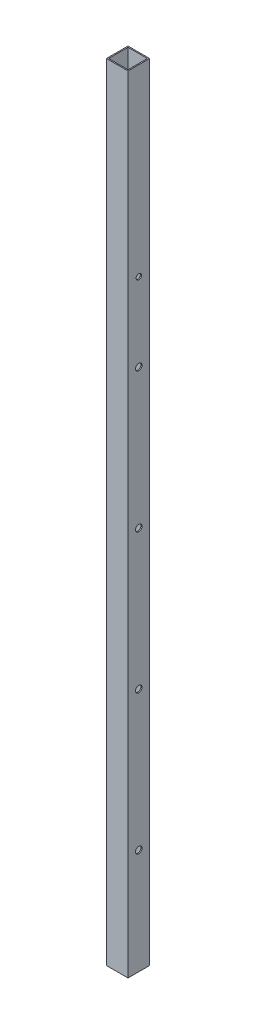
ISO-10303-21;
HEADER;
FILE_DESCRIPTION(('STEP AP214'),'2;1');
FILE_NAME('part.step','',(''),(''),'','','');
FILE_SCHEMA(('AUTOMOTIVE_DESIGN { 1 0 10303 214 1 1 1 1 }'));
ENDSEC;
DATA;
#1=APPLICATION_CONTEXT('core data for automotive mechanical design processes');
#2=APPLICATION_PROTOCOL_DEFINITION('international standard','automotive_design',2000,#1);
#3=PRODUCT_CONTEXT('',#1,'mechanical');
#4=PRODUCT('Part','Part','',(#3));
#5=PRODUCT_RELATED_PRODUCT_CATEGORY('part','',(#4));
#6=PRODUCT_DEFINITION_FORMATION('','',#4);
#7=PRODUCT_DEFINITION_CONTEXT('part definition',#1,'design');
#8=PRODUCT_DEFINITION('design','',#6,#7);
#9=PRODUCT_DEFINITION_SHAPE('','',#8);
#10=(LENGTH_UNIT() NAMED_UNIT(*) SI_UNIT(.MILLI.,.METRE.));
#11=(NAMED_UNIT(*) PLANE_ANGLE_UNIT() SI_UNIT($,.RADIAN.));
#12=(NAMED_UNIT(*) SI_UNIT($,.STERADIAN.) SOLID_ANGLE_UNIT());
#13=UNCERTAINTY_MEASURE_WITH_UNIT(LENGTH_MEASURE(1.E-05),#10,'distance_accuracy_value','');
#14=(GEOMETRIC_REPRESENTATION_CONTEXT(3) GLOBAL_UNCERTAINTY_ASSIGNED_CONTEXT((#13)) GLOBAL_UNIT_ASSIGNED_CONTEXT((#10,
#11,#12)) REPRESENTATION_CONTEXT('',''));
#15=CARTESIAN_POINT('',(0.,0.,0.));
#16=DIRECTION('',(0.,0.,1.));
#17=DIRECTION('',(1.,0.,0.));
#18=AXIS2_PLACEMENT_3D('',#15,#16,#17);
#19=CARTESIAN_POINT('',(-418.25,1630.,0.));
#20=DIRECTION('',(1.,0.,0.));
#21=DIRECTION('',(0.,0.,-1.));
#22=AXIS2_PLACEMENT_3D('',#19,#20,#21);
#23=CYLINDRICAL_SURFACE('',#22,9.52499999999999);
#24=CARTESIAN_POINT('',(28.575,1630.,0.));
#25=DIRECTION('',(-1.,0.,0.));
#26=DIRECTION('',(0.,0.,1.));
#27=AXIS2_PLACEMENT_3D('',#24,#25,#26);
#28=CIRCLE('',#27,9.52499999999999);
#29=CARTESIAN_POINT('',(28.575,1630.,9.52499999999999));
#30=VERTEX_POINT('',#29);
#31=EDGE_CURVE('E151',#30,#30,#28,.T.);
#32=ORIENTED_EDGE('',*,*,#31,.T.);
#33=EDGE_LOOP('',(#32));
#34=FACE_BOUND('',#33,.T.);
#35=CARTESIAN_POINT('',(31.75,1630.,0.));
#36=DIRECTION('',(1.,0.,0.));
#37=DIRECTION('',(0.,0.,-1.));
#38=AXIS2_PLACEMENT_3D('',#35,#36,#37);
#39=CIRCLE('',#38,9.52499999999999);
#40=CARTESIAN_POINT('',(31.75,1630.,-9.52499999999999));
#41=VERTEX_POINT('',#40);
#42=EDGE_CURVE('E41',#41,#41,#39,.T.);
#43=ORIENTED_EDGE('',*,*,#42,.T.);
#44=EDGE_LOOP('',(#43));
#45=FACE_BOUND('',#44,.T.);
#46=ADVANCED_FACE('F33',(#34,#45),#23,.F.);
#47=CARTESIAN_POINT('',(-418.25,1220.,0.));
#48=DIRECTION('',(1.,0.,0.));
#49=DIRECTION('',(0.,0.,-1.));
#50=AXIS2_PLACEMENT_3D('',#47,#48,#49);
#51=CYLINDRICAL_SURFACE('',#50,9.52499999999999);
#52=CARTESIAN_POINT('',(28.575,1220.,0.));
#53=DIRECTION('',(-1.,0.,0.));
#54=DIRECTION('',(0.,0.,1.));
#55=AXIS2_PLACEMENT_3D('',#52,#53,#54);
#56=CIRCLE('',#55,9.52499999999999);
#57=CARTESIAN_POINT('',(28.575,1220.,9.52499999999999));
#58=VERTEX_POINT('',#57);
#59=EDGE_CURVE('E145',#58,#58,#56,.T.);
#60=ORIENTED_EDGE('',*,*,#59,.T.);
#61=EDGE_LOOP('',(#60));
#62=FACE_BOUND('',#61,.T.);
#63=CARTESIAN_POINT('',(31.75,1220.,0.));
#64=DIRECTION('',(1.,0.,0.));
#65=DIRECTION('',(0.,0.,-1.));
#66=AXIS2_PLACEMENT_3D('',#63,#64,#65);
#67=CIRCLE('',#66,9.52499999999999);
#68=CARTESIAN_POINT('',(31.75,1220.,-9.52499999999999));
#69=VERTEX_POINT('',#68);
#70=EDGE_CURVE('E148',#69,#69,#67,.T.);
#71=ORIENTED_EDGE('',*,*,#70,.T.);
#72=EDGE_LOOP('',(#71));
#73=FACE_BOUND('',#72,.T.);
#74=ADVANCED_FACE('F179',(#62,#73),#51,.F.);
#75=CARTESIAN_POINT('',(-418.25,1630.,0.));
#76=DIRECTION('',(1.,0.,0.));
#77=DIRECTION('',(0.,0.,-1.));
#78=AXIS2_PLACEMENT_3D('',#75,#76,#77);
#79=CYLINDRICAL_SURFACE('',#78,9.52499999999999);
#80=CARTESIAN_POINT('',(-28.575,1630.,0.));
#81=DIRECTION('',(1.,0.,0.));
#82=DIRECTION('',(0.,0.,-1.));
#83=AXIS2_PLACEMENT_3D('',#80,#81,#82);
#84=CIRCLE('',#83,9.52499999999999);
#85=CARTESIAN_POINT('',(-28.575,1630.,-9.52499999999999));
#86=VERTEX_POINT('',#85);
#87=EDGE_CURVE('E139',#86,#86,#84,.T.);
#88=ORIENTED_EDGE('',*,*,#87,.T.);
#89=EDGE_LOOP('',(#88));
#90=FACE_BOUND('',#89,.T.);
#91=CARTESIAN_POINT('',(-31.75,1630.,0.));
#92=DIRECTION('',(1.,0.,0.));
#93=DIRECTION('',(0.,0.,-1.));
#94=AXIS2_PLACEMENT_3D('',#91,#92,#93);
#95=CIRCLE('',#94,9.52499999999999);
#96=CARTESIAN_POINT('',(-31.75,1630.,-9.52499999999999));
#97=VERTEX_POINT('',#96);
#98=EDGE_CURVE('E142',#97,#97,#95,.T.);
#99=ORIENTED_EDGE('',*,*,#98,.F.);
#100=EDGE_LOOP('',(#99));
#101=FACE_BOUND('',#100,.T.);
#102=ADVANCED_FACE('F184',(#90,#101),#79,.F.);
#103=CARTESIAN_POINT('',(-418.25,1220.,0.));
#104=DIRECTION('',(1.,0.,0.));
#105=DIRECTION('',(0.,0.,-1.));
#106=AXIS2_PLACEMENT_3D('',#103,#104,#105);
#107=CYLINDRICAL_SURFACE('',#106,9.52499999999999);
#108=CARTESIAN_POINT('',(-28.575,1220.,0.));
#109=DIRECTION('',(1.,0.,0.));
#110=DIRECTION('',(0.,0.,-1.));
#111=AXIS2_PLACEMENT_3D('',#108,#109,#110);
#112=CIRCLE('',#111,9.52499999999999);
#113=CARTESIAN_POINT('',(-28.575,1220.,-9.52499999999999));
#114=VERTEX_POINT('',#113);
#115=EDGE_CURVE('E128',#114,#114,#112,.T.);
#116=ORIENTED_EDGE('',*,*,#115,.T.);
#117=EDGE_LOOP('',(#116));
#118=FACE_BOUND('',#117,.T.);
#119=CARTESIAN_POINT('',(-31.75,1220.,0.));
#120=DIRECTION('',(1.,0.,0.));
#121=DIRECTION('',(0.,0.,-1.));
#122=AXIS2_PLACEMENT_3D('',#119,#120,#121);
#123=CIRCLE('',#122,9.52499999999999);
#124=CARTESIAN_POINT('',(-31.75,1220.,-9.52499999999999));
#125=VERTEX_POINT('',#124);
#126=EDGE_CURVE('E136',#125,#125,#123,.T.);
#127=ORIENTED_EDGE('',*,*,#126,.F.);
#128=EDGE_LOOP('',(#127));
#129=FACE_BOUND('',#128,.T.);
#130=ADVANCED_FACE('F172',(#118,#129),#107,.F.);
#131=CARTESIAN_POINT('',(0.,2400.,0.));
#132=DIRECTION('',(0.,-1.,0.));
#133=DIRECTION('',(0.,0.,-1.));
#134=AXIS2_PLACEMENT_3D('',#131,#132,#133);
#135=PLANE('',#134);
#136=DIRECTION('',(0.,0.,-1.));
#137=VECTOR('',#136,1.);
#138=CARTESIAN_POINT('',(31.75,2400.,31.75));
#139=LINE('',#138,#137);
#140=CARTESIAN_POINT('',(31.75,2400.,31.75));
#141=VERTEX_POINT('',#140);
#142=CARTESIAN_POINT('',(31.75,2400.,-31.75));
#143=VERTEX_POINT('',#142);
#144=EDGE_CURVE('E255',#141,#143,#139,.T.);
#145=ORIENTED_EDGE('',*,*,#144,.T.);
#146=DIRECTION('',(-1.,0.,0.));
#147=VECTOR('',#146,1.);
#148=CARTESIAN_POINT('',(-31.75,2400.,-31.75));
#149=LINE('',#148,#147);
#150=CARTESIAN_POINT('',(-31.75,2400.,-31.75));
#151=VERTEX_POINT('',#150);
#152=EDGE_CURVE('E258',#143,#151,#149,.T.);
#153=ORIENTED_EDGE('',*,*,#152,.T.);
#154=DIRECTION('',(0.,0.,1.));
#155=VECTOR('',#154,1.);
#156=CARTESIAN_POINT('',(-31.75,2400.,31.75));
#157=LINE('',#156,#155);
#158=CARTESIAN_POINT('',(-31.75,2400.,31.75));
#159=VERTEX_POINT('',#158);
#160=EDGE_CURVE('E260',#151,#159,#157,.T.);
#161=ORIENTED_EDGE('',*,*,#160,.T.);
#162=DIRECTION('',(1.,0.,0.));
#163=VECTOR('',#162,1.);
#164=CARTESIAN_POINT('',(-31.75,2400.,31.75));
#165=LINE('',#164,#163);
#166=EDGE_CURVE('E118',#159,#141,#165,.T.);
#167=ORIENTED_EDGE('',*,*,#166,.T.);
#168=EDGE_LOOP('',(#145,#153,#161,#167));
#169=FACE_BOUND('',#168,.T.);
#170=DIRECTION('',(0.,0.,1.));
#171=VECTOR('',#170,1.);
#172=CARTESIAN_POINT('',(-28.575,2400.,28.575));
#173=LINE('',#172,#171);
#174=CARTESIAN_POINT('',(-28.575,2400.,-28.575));
#175=VERTEX_POINT('',#174);
#176=CARTESIAN_POINT('',(-28.575,2400.,28.575));
#177=VERTEX_POINT('',#176);
#178=EDGE_CURVE('E229',#175,#177,#173,.T.);
#179=ORIENTED_EDGE('',*,*,#178,.F.);
#180=DIRECTION('',(-1.,0.,0.));
#181=VECTOR('',#180,1.);
#182=CARTESIAN_POINT('',(-28.575,2400.,-28.575));
#183=LINE('',#182,#181);
#184=CARTESIAN_POINT('',(28.575,2400.,-28.575));
#185=VERTEX_POINT('',#184);
#186=EDGE_CURVE('E241',#185,#175,#183,.T.);
#187=ORIENTED_EDGE('',*,*,#186,.F.);
#188=DIRECTION('',(0.,0.,-1.));
#189=VECTOR('',#188,1.);
#190=CARTESIAN_POINT('',(28.575,2400.,28.575));
#191=LINE('',#190,#189);
#192=CARTESIAN_POINT('',(28.575,2400.,28.575));
#193=VERTEX_POINT('',#192);
#194=EDGE_CURVE('E238',#193,#185,#191,.T.);
#195=ORIENTED_EDGE('',*,*,#194,.F.);
#196=DIRECTION('',(1.,0.,0.));
#197=VECTOR('',#196,1.);
#198=CARTESIAN_POINT('',(-28.575,2400.,28.575));
#199=LINE('',#198,#197);
#200=EDGE_CURVE('E231',#177,#193,#199,.T.);
#201=ORIENTED_EDGE('',*,*,#200,.F.);
#202=EDGE_LOOP('',(#179,#187,#195,#201));
#203=FACE_BOUND('',#202,.T.);
#204=ADVANCED_FACE('F161',(#169,#203),#135,.F.);
#205=CARTESIAN_POINT('',(31.75,2400.,31.75));
#206=DIRECTION('',(-1.,0.,0.));
#207=DIRECTION('',(0.,0.,1.));
#208=AXIS2_PLACEMENT_3D('',#205,#206,#207);
#209=PLANE('',#208);
#210=CARTESIAN_POINT('',(31.75,1860.,0.));
#211=DIRECTION('',(-1.,0.,0.));
#212=DIRECTION('',(0.,0.,1.));
#213=AXIS2_PLACEMENT_3D('',#210,#211,#212);
#214=CIRCLE('',#213,7.93749999999998);
#215=CARTESIAN_POINT('',(31.75,1860.,7.93750000000005));
#216=VERTEX_POINT('',#215);
#217=EDGE_CURVE('E317',#216,#216,#214,.F.);
#218=ORIENTED_EDGE('',*,*,#217,.F.);
#219=EDGE_LOOP('',(#218));
#220=FACE_BOUND('',#219,.T.);
#221=CARTESIAN_POINT('',(31.75,810.,0.));
#222=DIRECTION('',(1.,0.,0.));
#223=DIRECTION('',(0.,0.,-1.));
#224=AXIS2_PLACEMENT_3D('',#221,#222,#223);
#225=CIRCLE('',#224,9.52499999999999);
#226=CARTESIAN_POINT('',(31.75,810.,-9.52499999999999));
#227=VERTEX_POINT('',#226);
#228=EDGE_CURVE('E278',#227,#227,#225,.T.);
#229=ORIENTED_EDGE('',*,*,#228,.F.);
#230=EDGE_LOOP('',(#229));
#231=FACE_BOUND('',#230,.T.);
#232=CARTESIAN_POINT('',(31.75,400.,0.));
#233=DIRECTION('',(1.,0.,0.));
#234=DIRECTION('',(0.,0.,-1.));
#235=AXIS2_PLACEMENT_3D('',#232,#233,#234);
#236=CIRCLE('',#235,9.52499999999999);
#237=CARTESIAN_POINT('',(31.75,400.,-9.52499999999999));
#238=VERTEX_POINT('',#237);
#239=EDGE_CURVE('E133',#238,#238,#236,.T.);
#240=ORIENTED_EDGE('',*,*,#239,.F.);
#241=EDGE_LOOP('',(#240));
#242=FACE_BOUND('',#241,.T.);
#243=DIRECTION('',(0.,-1.,0.));
#244=VECTOR('',#243,1.);
#245=CARTESIAN_POINT('',(31.75,2400.,31.75));
#246=LINE('',#245,#244);
#247=CARTESIAN_POINT('',(31.75,89.9999999999999,31.75));
#248=VERTEX_POINT('',#247);
#249=EDGE_CURVE('E119',#141,#248,#246,.T.);
#250=ORIENTED_EDGE('',*,*,#249,.T.);
#251=DIRECTION('',(0.,0.,-1.));
#252=VECTOR('',#251,1.);
#253=CARTESIAN_POINT('',(31.75,89.9999999999999,31.75));
#254=LINE('',#253,#252);
#255=CARTESIAN_POINT('',(31.75,90.,-31.75));
#256=VERTEX_POINT('',#255);
#257=EDGE_CURVE('E48',#248,#256,#254,.T.);
#258=ORIENTED_EDGE('',*,*,#257,.T.);
#259=DIRECTION('',(0.,-1.,0.));
#260=VECTOR('',#259,1.);
#261=CARTESIAN_POINT('',(31.75,2400.,-31.75));
#262=LINE('',#261,#260);
#263=EDGE_CURVE('E121',#143,#256,#262,.T.);
#264=ORIENTED_EDGE('',*,*,#263,.F.);
#265=ORIENTED_EDGE('',*,*,#144,.F.);
#266=EDGE_LOOP('',(#250,#258,#264,#265));
#267=FACE_BOUND('',#266,.T.);
#268=ORIENTED_EDGE('',*,*,#70,.F.);
#269=EDGE_LOOP('',(#268));
#270=FACE_BOUND('',#269,.T.);
#271=ORIENTED_EDGE('',*,*,#42,.F.);
#272=EDGE_LOOP('',(#271));
#273=FACE_BOUND('',#272,.T.);
#274=ADVANCED_FACE('F158',(#220,#231,#242,#267,#270,#273),#209,.F.);
#275=CARTESIAN_POINT('',(-31.75,2400.,-31.75));
#276=DIRECTION('',(0.,0.,1.));
#277=DIRECTION('',(1.,0.,0.));
#278=AXIS2_PLACEMENT_3D('',#275,#276,#277);
#279=PLANE('',#278);
#280=ORIENTED_EDGE('',*,*,#263,.T.);
#281=DIRECTION('',(-1.,0.,0.));
#282=VECTOR('',#281,1.);
#283=CARTESIAN_POINT('',(168.25,90.,-31.75));
#284=LINE('',#283,#282);
#285=CARTESIAN_POINT('',(-31.75,90.,-31.75));
#286=VERTEX_POINT('',#285);
#287=EDGE_CURVE('E103',#256,#286,#284,.T.);
#288=ORIENTED_EDGE('',*,*,#287,.T.);
#289=DIRECTION('',(0.,-1.,0.));
#290=VECTOR('',#289,1.);
#291=CARTESIAN_POINT('',(-31.75,2400.,-31.75));
#292=LINE('',#291,#290);
#293=EDGE_CURVE('E114',#151,#286,#292,.T.);
#294=ORIENTED_EDGE('',*,*,#293,.F.);
#295=ORIENTED_EDGE('',*,*,#152,.F.);
#296=EDGE_LOOP('',(#280,#288,#294,#295));
#297=FACE_BOUND('',#296,.T.);
#298=ADVANCED_FACE('F160',(#297),#279,.F.);
#299=CARTESIAN_POINT('',(-31.75,2400.,31.75));
#300=DIRECTION('',(1.,0.,0.));
#301=DIRECTION('',(0.,0.,-1.));
#302=AXIS2_PLACEMENT_3D('',#299,#300,#301);
#303=PLANE('',#302);
#304=CARTESIAN_POINT('',(-31.75,1860.,0.));
#305=DIRECTION('',(-1.,0.,0.));
#306=DIRECTION('',(0.,0.,1.));
#307=AXIS2_PLACEMENT_3D('',#304,#305,#306);
#308=CIRCLE('',#307,7.93749999999998);
#309=CARTESIAN_POINT('',(-31.75,1860.,7.93750000000005));
#310=VERTEX_POINT('',#309);
#311=EDGE_CURVE('E220',#310,#310,#308,.T.);
#312=ORIENTED_EDGE('',*,*,#311,.F.);
#313=EDGE_LOOP('',(#312));
#314=FACE_BOUND('',#313,.T.);
#315=CARTESIAN_POINT('',(-31.75,810.,0.));
#316=DIRECTION('',(1.,0.,0.));
#317=DIRECTION('',(0.,0.,-1.));
#318=AXIS2_PLACEMENT_3D('',#315,#316,#317);
#319=CIRCLE('',#318,9.52499999999999);
#320=CARTESIAN_POINT('',(-31.75,810.,-9.52499999999999));
#321=VERTEX_POINT('',#320);
#322=EDGE_CURVE('E224',#321,#321,#319,.T.);
#323=ORIENTED_EDGE('',*,*,#322,.T.);
#324=EDGE_LOOP('',(#323));
#325=FACE_BOUND('',#324,.T.);
#326=CARTESIAN_POINT('',(-31.75,400.,0.));
#327=DIRECTION('',(1.,0.,0.));
#328=DIRECTION('',(0.,0.,-1.));
#329=AXIS2_PLACEMENT_3D('',#326,#327,#328);
#330=CIRCLE('',#329,9.52499999999999);
#331=CARTESIAN_POINT('',(-31.75,400.,-9.52499999999999));
#332=VERTEX_POINT('',#331);
#333=EDGE_CURVE('E227',#332,#332,#330,.T.);
#334=ORIENTED_EDGE('',*,*,#333,.T.);
#335=EDGE_LOOP('',(#334));
#336=FACE_BOUND('',#335,.T.);
#337=ORIENTED_EDGE('',*,*,#293,.T.);
#338=DIRECTION('',(0.,0.,-1.));
#339=VECTOR('',#338,1.);
#340=CARTESIAN_POINT('',(-31.75,90.,-31.75));
#341=LINE('',#340,#339);
#342=CARTESIAN_POINT('',(-31.75,90.,31.75));
#343=VERTEX_POINT('',#342);
#344=EDGE_CURVE('E97',#343,#286,#341,.T.);
#345=ORIENTED_EDGE('',*,*,#344,.F.);
#346=DIRECTION('',(0.,-1.,0.));
#347=VECTOR('',#346,1.);
#348=CARTESIAN_POINT('',(-31.75,2400.,31.75));
#349=LINE('',#348,#347);
#350=EDGE_CURVE('E111',#159,#343,#349,.T.);
#351=ORIENTED_EDGE('',*,*,#350,.F.);
#352=ORIENTED_EDGE('',*,*,#160,.F.);
#353=EDGE_LOOP('',(#337,#345,#351,#352));
#354=FACE_BOUND('',#353,.T.);
#355=ORIENTED_EDGE('',*,*,#126,.T.);
#356=EDGE_LOOP('',(#355));
#357=FACE_BOUND('',#356,.T.);
#358=ORIENTED_EDGE('',*,*,#98,.T.);
#359=EDGE_LOOP('',(#358));
#360=FACE_BOUND('',#359,.T.);
#361=ADVANCED_FACE('F108',(#314,#325,#336,#354,#357,#360),#303,.F.);
#362=CARTESIAN_POINT('',(-31.75,2400.,31.75));
#363=DIRECTION('',(0.,0.,-1.));
#364=DIRECTION('',(-1.,0.,0.));
#365=AXIS2_PLACEMENT_3D('',#362,#363,#364);
#366=PLANE('',#365);
#367=ORIENTED_EDGE('',*,*,#350,.T.);
#368=DIRECTION('',(-1.,0.,0.));
#369=VECTOR('',#368,1.);
#370=CARTESIAN_POINT('',(168.25,90.,31.75));
#371=LINE('',#370,#369);
#372=EDGE_CURVE('E94',#248,#343,#371,.T.);
#373=ORIENTED_EDGE('',*,*,#372,.F.);
#374=ORIENTED_EDGE('',*,*,#249,.F.);
#375=ORIENTED_EDGE('',*,*,#166,.F.);
#376=EDGE_LOOP('',(#367,#373,#374,#375));
#377=FACE_BOUND('',#376,.T.);
#378=ADVANCED_FACE('F117',(#377),#366,.F.);
#379=CARTESIAN_POINT('',(-28.575,2400.,28.575));
#380=DIRECTION('',(1.,0.,0.));
#381=DIRECTION('',(0.,0.,-1.));
#382=AXIS2_PLACEMENT_3D('',#379,#380,#381);
#383=PLANE('',#382);
#384=CARTESIAN_POINT('',(-28.575,1860.,0.));
#385=DIRECTION('',(1.,0.,0.));
#386=DIRECTION('',(0.,0.,-1.));
#387=AXIS2_PLACEMENT_3D('',#384,#385,#386);
#388=CIRCLE('',#387,7.93749999999998);
#389=CARTESIAN_POINT('',(-28.575,1860.,-7.93749999999991));
#390=VERTEX_POINT('',#389);
#391=EDGE_CURVE('E115',#390,#390,#388,.T.);
#392=ORIENTED_EDGE('',*,*,#391,.F.);
#393=EDGE_LOOP('',(#392));
#394=FACE_BOUND('',#393,.T.);
#395=DIRECTION('',(0.,0.,1.));
#396=VECTOR('',#395,1.);
#397=CARTESIAN_POINT('',(-28.575,89.9999999999999,28.575));
#398=LINE('',#397,#396);
#399=CARTESIAN_POINT('',(-28.575,89.9999999999999,-28.575));
#400=VERTEX_POINT('',#399);
#401=CARTESIAN_POINT('',(-28.575,89.9999999999999,28.575));
#402=VERTEX_POINT('',#401);
#403=EDGE_CURVE('E272',#400,#402,#398,.T.);
#404=ORIENTED_EDGE('',*,*,#403,.F.);
#405=DIRECTION('',(0.,-1.,0.));
#406=VECTOR('',#405,1.);
#407=CARTESIAN_POINT('',(-28.575,2400.,-28.575));
#408=LINE('',#407,#406);
#409=EDGE_CURVE('E243',#175,#400,#408,.T.);
#410=ORIENTED_EDGE('',*,*,#409,.F.);
#411=ORIENTED_EDGE('',*,*,#178,.T.);
#412=DIRECTION('',(0.,-1.,0.));
#413=VECTOR('',#412,1.);
#414=CARTESIAN_POINT('',(-28.575,2400.,28.575));
#415=LINE('',#414,#413);
#416=EDGE_CURVE('E252',#177,#402,#415,.T.);
#417=ORIENTED_EDGE('',*,*,#416,.T.);
#418=EDGE_LOOP('',(#404,#410,#411,#417));
#419=FACE_BOUND('',#418,.T.);
#420=CARTESIAN_POINT('',(-28.575,810.,0.));
#421=DIRECTION('',(1.,0.,0.));
#422=DIRECTION('',(0.,0.,-1.));
#423=AXIS2_PLACEMENT_3D('',#420,#421,#422);
#424=CIRCLE('',#423,9.52499999999999);
#425=CARTESIAN_POINT('',(-28.575,810.,-9.52499999999999));
#426=VERTEX_POINT('',#425);
#427=EDGE_CURVE('E281',#426,#426,#424,.T.);
#428=ORIENTED_EDGE('',*,*,#427,.F.);
#429=EDGE_LOOP('',(#428));
#430=FACE_BOUND('',#429,.T.);
#431=CARTESIAN_POINT('',(-28.575,400.,0.));
#432=DIRECTION('',(1.,0.,0.));
#433=DIRECTION('',(0.,0.,-1.));
#434=AXIS2_PLACEMENT_3D('',#431,#432,#433);
#435=CIRCLE('',#434,9.52499999999999);
#436=CARTESIAN_POINT('',(-28.575,400.,-9.52499999999999));
#437=VERTEX_POINT('',#436);
#438=EDGE_CURVE('E132',#437,#437,#435,.T.);
#439=ORIENTED_EDGE('',*,*,#438,.F.);
#440=EDGE_LOOP('',(#439));
#441=FACE_BOUND('',#440,.T.);
#442=ORIENTED_EDGE('',*,*,#115,.F.);
#443=EDGE_LOOP('',(#442));
#444=FACE_BOUND('',#443,.T.);
#445=ORIENTED_EDGE('',*,*,#87,.F.);
#446=EDGE_LOOP('',(#445));
#447=FACE_BOUND('',#446,.T.);
#448=ADVANCED_FACE('F203',(#394,#419,#430,#441,#444,#447),#383,.T.);
#449=CARTESIAN_POINT('',(-28.575,2400.,28.575));
#450=DIRECTION('',(0.,0.,-1.));
#451=DIRECTION('',(-1.,0.,0.));
#452=AXIS2_PLACEMENT_3D('',#449,#450,#451);
#453=PLANE('',#452);
#454=DIRECTION('',(1.,0.,0.));
#455=VECTOR('',#454,1.);
#456=CARTESIAN_POINT('',(-28.575,89.9999999999999,28.575));
#457=LINE('',#456,#455);
#458=CARTESIAN_POINT('',(28.575,89.9999999999999,28.575));
#459=VERTEX_POINT('',#458);
#460=EDGE_CURVE('E267',#402,#459,#457,.T.);
#461=ORIENTED_EDGE('',*,*,#460,.F.);
#462=ORIENTED_EDGE('',*,*,#416,.F.);
#463=ORIENTED_EDGE('',*,*,#200,.T.);
#464=DIRECTION('',(0.,-1.,0.));
#465=VECTOR('',#464,1.);
#466=CARTESIAN_POINT('',(28.575,2400.,28.575));
#467=LINE('',#466,#465);
#468=EDGE_CURVE('E249',#193,#459,#467,.T.);
#469=ORIENTED_EDGE('',*,*,#468,.T.);
#470=EDGE_LOOP('',(#461,#462,#463,#469));
#471=FACE_BOUND('',#470,.T.);
#472=ADVANCED_FACE('F191',(#471),#453,.T.);
#473=CARTESIAN_POINT('',(28.575,2400.,28.575));
#474=DIRECTION('',(-1.,0.,0.));
#475=DIRECTION('',(0.,0.,1.));
#476=AXIS2_PLACEMENT_3D('',#473,#474,#475);
#477=PLANE('',#476);
#478=CARTESIAN_POINT('',(28.575,1860.,0.));
#479=DIRECTION('',(-1.,0.,0.));
#480=DIRECTION('',(0.,0.,1.));
#481=AXIS2_PLACEMENT_3D('',#478,#479,#480);
#482=CIRCLE('',#481,7.93749999999998);
#483=CARTESIAN_POINT('',(28.575,1860.,7.93750000000005));
#484=VERTEX_POINT('',#483);
#485=EDGE_CURVE('E36',#484,#484,#482,.T.);
#486=ORIENTED_EDGE('',*,*,#485,.F.);
#487=EDGE_LOOP('',(#486));
#488=FACE_BOUND('',#487,.T.);
#489=DIRECTION('',(0.,0.,-1.));
#490=VECTOR('',#489,1.);
#491=CARTESIAN_POINT('',(28.575,89.9999999999999,28.575));
#492=LINE('',#491,#490);
#493=CARTESIAN_POINT('',(28.575,89.9999999999999,-28.575));
#494=VERTEX_POINT('',#493);
#495=EDGE_CURVE('E55',#459,#494,#492,.T.);
#496=ORIENTED_EDGE('',*,*,#495,.F.);
#497=ORIENTED_EDGE('',*,*,#468,.F.);
#498=ORIENTED_EDGE('',*,*,#194,.T.);
#499=DIRECTION('',(0.,-1.,0.));
#500=VECTOR('',#499,1.);
#501=CARTESIAN_POINT('',(28.575,2400.,-28.575));
#502=LINE('',#501,#500);
#503=EDGE_CURVE('E246',#185,#494,#502,.T.);
#504=ORIENTED_EDGE('',*,*,#503,.T.);
#505=EDGE_LOOP('',(#496,#497,#498,#504));
#506=FACE_BOUND('',#505,.T.);
#507=CARTESIAN_POINT('',(28.575,810.,0.));
#508=DIRECTION('',(-1.,0.,0.));
#509=DIRECTION('',(0.,0.,1.));
#510=AXIS2_PLACEMENT_3D('',#507,#508,#509);
#511=CIRCLE('',#510,9.52499999999999);
#512=CARTESIAN_POINT('',(28.575,810.,9.52499999999999));
#513=VERTEX_POINT('',#512);
#514=EDGE_CURVE('E275',#513,#513,#511,.T.);
#515=ORIENTED_EDGE('',*,*,#514,.F.);
#516=EDGE_LOOP('',(#515));
#517=FACE_BOUND('',#516,.T.);
#518=CARTESIAN_POINT('',(28.575,400.,0.));
#519=DIRECTION('',(-1.,0.,0.));
#520=DIRECTION('',(0.,0.,1.));
#521=AXIS2_PLACEMENT_3D('',#518,#519,#520);
#522=CIRCLE('',#521,9.52499999999999);
#523=CARTESIAN_POINT('',(28.575,400.,9.52499999999999));
#524=VERTEX_POINT('',#523);
#525=EDGE_CURVE('E129',#524,#524,#522,.T.);
#526=ORIENTED_EDGE('',*,*,#525,.F.);
#527=EDGE_LOOP('',(#526));
#528=FACE_BOUND('',#527,.T.);
#529=ORIENTED_EDGE('',*,*,#59,.F.);
#530=EDGE_LOOP('',(#529));
#531=FACE_BOUND('',#530,.T.);
#532=ORIENTED_EDGE('',*,*,#31,.F.);
#533=EDGE_LOOP('',(#532));
#534=FACE_BOUND('',#533,.T.);
#535=ADVANCED_FACE('F188',(#488,#506,#517,#528,#531,#534),#477,.T.);
#536=CARTESIAN_POINT('',(-28.575,2400.,-28.575));
#537=DIRECTION('',(0.,0.,1.));
#538=DIRECTION('',(1.,0.,0.));
#539=AXIS2_PLACEMENT_3D('',#536,#537,#538);
#540=PLANE('',#539);
#541=DIRECTION('',(-1.,0.,0.));
#542=VECTOR('',#541,1.);
#543=CARTESIAN_POINT('',(-28.575,89.9999999999999,-28.575));
#544=LINE('',#543,#542);
#545=EDGE_CURVE('E11',#494,#400,#544,.T.);
#546=ORIENTED_EDGE('',*,*,#545,.F.);
#547=ORIENTED_EDGE('',*,*,#503,.F.);
#548=ORIENTED_EDGE('',*,*,#186,.T.);
#549=ORIENTED_EDGE('',*,*,#409,.T.);
#550=EDGE_LOOP('',(#546,#547,#548,#549));
#551=FACE_BOUND('',#550,.T.);
#552=ADVANCED_FACE('F190',(#551),#540,.T.);
#553=CARTESIAN_POINT('',(-418.25,400.,0.));
#554=DIRECTION('',(1.,0.,0.));
#555=DIRECTION('',(0.,0.,-1.));
#556=AXIS2_PLACEMENT_3D('',#553,#554,#555);
#557=CYLINDRICAL_SURFACE('',#556,9.52499999999999);
#558=ORIENTED_EDGE('',*,*,#525,.T.);
#559=EDGE_LOOP('',(#558));
#560=FACE_BOUND('',#559,.T.);
#561=ORIENTED_EDGE('',*,*,#239,.T.);
#562=EDGE_LOOP('',(#561));
#563=FACE_BOUND('',#562,.T.);
#564=ADVANCED_FACE('F199',(#560,#563),#557,.F.);
#565=ORIENTED_EDGE('',*,*,#438,.T.);
#566=EDGE_LOOP('',(#565));
#567=FACE_BOUND('',#566,.T.);
#568=ORIENTED_EDGE('',*,*,#333,.F.);
#569=EDGE_LOOP('',(#568));
#570=FACE_BOUND('',#569,.T.);
#571=ADVANCED_FACE('F289',(#567,#570),#557,.F.);
#572=CARTESIAN_POINT('',(-418.25,810.,0.));
#573=DIRECTION('',(1.,0.,0.));
#574=DIRECTION('',(0.,0.,-1.));
#575=AXIS2_PLACEMENT_3D('',#572,#573,#574);
#576=CYLINDRICAL_SURFACE('',#575,9.52499999999999);
#577=ORIENTED_EDGE('',*,*,#427,.T.);
#578=EDGE_LOOP('',(#577));
#579=FACE_BOUND('',#578,.T.);
#580=ORIENTED_EDGE('',*,*,#322,.F.);
#581=EDGE_LOOP('',(#580));
#582=FACE_BOUND('',#581,.T.);
#583=ADVANCED_FACE('F295',(#579,#582),#576,.F.);
#584=CARTESIAN_POINT('',(-418.25,810.,0.));
#585=DIRECTION('',(1.,0.,0.));
#586=DIRECTION('',(0.,0.,-1.));
#587=AXIS2_PLACEMENT_3D('',#584,#585,#586);
#588=CYLINDRICAL_SURFACE('',#587,9.52499999999999);
#589=ORIENTED_EDGE('',*,*,#514,.T.);
#590=EDGE_LOOP('',(#589));
#591=FACE_BOUND('',#590,.T.);
#592=ORIENTED_EDGE('',*,*,#228,.T.);
#593=EDGE_LOOP('',(#592));
#594=FACE_BOUND('',#593,.T.);
#595=ADVANCED_FACE('F300',(#591,#594),#588,.F.);
#596=CARTESIAN_POINT('',(168.25,90.,-31.75));
#597=DIRECTION('',(0.,1.,0.));
#598=DIRECTION('',(0.,0.,1.));
#599=AXIS2_PLACEMENT_3D('',#596,#597,#598);
#600=PLANE('',#599);
#601=ORIENTED_EDGE('',*,*,#403,.T.);
#602=ORIENTED_EDGE('',*,*,#460,.T.);
#603=ORIENTED_EDGE('',*,*,#495,.T.);
#604=ORIENTED_EDGE('',*,*,#545,.T.);
#605=EDGE_LOOP('',(#601,#602,#603,#604));
#606=FACE_BOUND('',#605,.T.);
#607=ORIENTED_EDGE('',*,*,#372,.T.);
#608=ORIENTED_EDGE('',*,*,#344,.T.);
#609=ORIENTED_EDGE('',*,*,#287,.F.);
#610=ORIENTED_EDGE('',*,*,#257,.F.);
#611=EDGE_LOOP('',(#607,#608,#609,#610));
#612=FACE_BOUND('',#611,.T.);
#613=ADVANCED_FACE('F96',(#606,#612),#600,.F.);
#614=CARTESIAN_POINT('',(54.2006403026728,1860.,0.));
#615=DIRECTION('',(-1.,0.,0.));
#616=DIRECTION('',(0.,0.,1.));
#617=AXIS2_PLACEMENT_3D('',#614,#615,#616);
#618=CYLINDRICAL_SURFACE('',#617,7.93749999999998);
#619=ORIENTED_EDGE('',*,*,#485,.T.);
#620=EDGE_LOOP('',(#619));
#621=FACE_BOUND('',#620,.T.);
#622=ORIENTED_EDGE('',*,*,#217,.T.);
#623=EDGE_LOOP('',(#622));
#624=FACE_BOUND('',#623,.T.);
#625=ADVANCED_FACE('F307',(#621,#624),#618,.F.);
#626=ORIENTED_EDGE('',*,*,#391,.T.);
#627=EDGE_LOOP('',(#626));
#628=FACE_BOUND('',#627,.T.);
#629=ORIENTED_EDGE('',*,*,#311,.T.);
#630=EDGE_LOOP('',(#629));
#631=FACE_BOUND('',#630,.T.);
#632=ADVANCED_FACE('F309',(#628,#631),#618,.F.);
#633=CLOSED_SHELL('',(#46,#74,#102,#130,#204,#274,#298,#361,#378,#448,#472,#535,#552,#564,#571,
#583,#595,#613,#625,#632));
#634=MANIFOLD_SOLID_BREP('B2',#633);
#635=ADVANCED_BREP_SHAPE_REPRESENTATION('',(#18,#634),#14);
#636=SHAPE_DEFINITION_REPRESENTATION(#9,#635);
ENDSEC;
END-ISO-10303-21;
